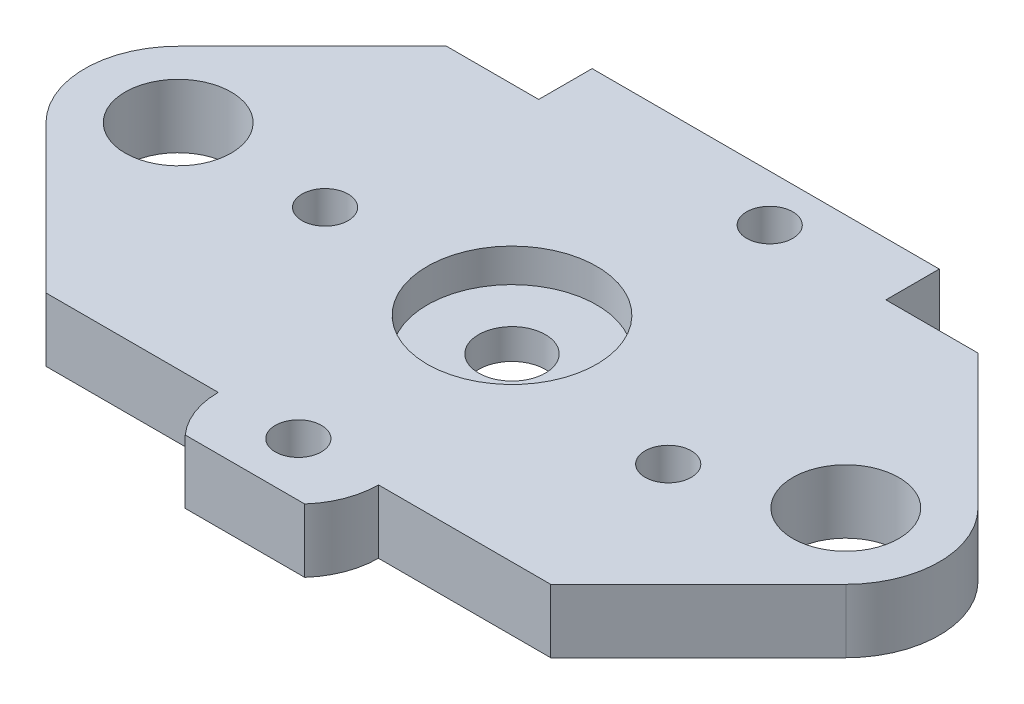
ISO-10303-21;
HEADER;
FILE_DESCRIPTION(('STEP AP214'),'2;1');
FILE_NAME('part.step','',(''),(''),'','','');
FILE_SCHEMA(('AUTOMOTIVE_DESIGN { 1 0 10303 214 1 1 1 1 }'));
ENDSEC;
DATA;
#1=APPLICATION_CONTEXT('core data for automotive mechanical design processes');
#2=APPLICATION_PROTOCOL_DEFINITION('international standard','automotive_design',2000,#1);
#3=PRODUCT_CONTEXT('',#1,'mechanical');
#4=PRODUCT('Part','Part','',(#3));
#5=PRODUCT_RELATED_PRODUCT_CATEGORY('part','',(#4));
#6=PRODUCT_DEFINITION_FORMATION('','',#4);
#7=PRODUCT_DEFINITION_CONTEXT('part definition',#1,'design');
#8=PRODUCT_DEFINITION('design','',#6,#7);
#9=PRODUCT_DEFINITION_SHAPE('','',#8);
#10=(LENGTH_UNIT() NAMED_UNIT(*) SI_UNIT(.MILLI.,.METRE.));
#11=(NAMED_UNIT(*) PLANE_ANGLE_UNIT() SI_UNIT($,.RADIAN.));
#12=(NAMED_UNIT(*) SI_UNIT($,.STERADIAN.) SOLID_ANGLE_UNIT());
#13=UNCERTAINTY_MEASURE_WITH_UNIT(LENGTH_MEASURE(1.E-05),#10,'distance_accuracy_value','');
#14=(GEOMETRIC_REPRESENTATION_CONTEXT(3) GLOBAL_UNCERTAINTY_ASSIGNED_CONTEXT((#13)) GLOBAL_UNIT_ASSIGNED_CONTEXT((#10,
#11,#12)) REPRESENTATION_CONTEXT('',''));
#15=CARTESIAN_POINT('',(0.,0.,0.));
#16=DIRECTION('',(0.,0.,1.));
#17=DIRECTION('',(1.,0.,0.));
#18=AXIS2_PLACEMENT_3D('',#15,#16,#17);
#19=CARTESIAN_POINT('',(0.,0.,0.));
#20=DIRECTION('',(0.,1.,0.));
#21=DIRECTION('',(0.,0.,1.));
#22=AXIS2_PLACEMENT_3D('',#19,#20,#21);
#23=CYLINDRICAL_SURFACE('',#22,2.5);
#24=CARTESIAN_POINT('',(0.,0.,0.));
#25=DIRECTION('',(0.,1.,0.));
#26=DIRECTION('',(0.,0.,1.));
#27=AXIS2_PLACEMENT_3D('',#24,#25,#26);
#28=CIRCLE('',#27,2.5);
#29=CARTESIAN_POINT('',(0.,0.,2.5));
#30=VERTEX_POINT('',#29);
#31=EDGE_CURVE('E11',#30,#30,#28,.T.);
#32=ORIENTED_EDGE('',*,*,#31,.F.);
#33=EDGE_LOOP('',(#32));
#34=FACE_BOUND('',#33,.T.);
#35=CARTESIAN_POINT('',(0.,2.2625,0.));
#36=DIRECTION('',(0.,1.,0.));
#37=DIRECTION('',(0.,0.,1.));
#38=AXIS2_PLACEMENT_3D('',#35,#36,#37);
#39=CIRCLE('',#38,2.5);
#40=CARTESIAN_POINT('',(0.,2.2625,2.5));
#41=VERTEX_POINT('',#40);
#42=EDGE_CURVE('E35',#41,#41,#39,.F.);
#43=ORIENTED_EDGE('',*,*,#42,.F.);
#44=EDGE_LOOP('',(#43));
#45=FACE_BOUND('',#44,.T.);
#46=ADVANCED_FACE('F31',(#34,#45),#23,.F.);
#47=CARTESIAN_POINT('',(-32.5,4.7625,22.5));
#48=DIRECTION('',(0.,1.,0.));
#49=DIRECTION('',(0.,0.,1.));
#50=AXIS2_PLACEMENT_3D('',#47,#48,#49);
#51=PLANE('',#50);
#52=CARTESIAN_POINT('',(0.,4.7625,0.));
#53=DIRECTION('',(0.,1.,0.));
#54=DIRECTION('',(0.,0.,1.));
#55=AXIS2_PLACEMENT_3D('',#52,#53,#54);
#56=CIRCLE('',#55,6.35);
#57=CARTESIAN_POINT('',(0.,4.7625,6.35));
#58=VERTEX_POINT('',#57);
#59=EDGE_CURVE('E469',#58,#58,#56,.T.);
#60=ORIENTED_EDGE('',*,*,#59,.F.);
#61=EDGE_LOOP('',(#60));
#62=FACE_BOUND('',#61,.T.);
#63=CARTESIAN_POINT('',(0.,4.7625,16.));
#64=DIRECTION('',(0.,1.,0.));
#65=DIRECTION('',(0.,0.,1.));
#66=AXIS2_PLACEMENT_3D('',#63,#64,#65);
#67=CIRCLE('',#66,1.72719999999999);
#68=CARTESIAN_POINT('',(0.,4.7625,17.7272));
#69=VERTEX_POINT('',#68);
#70=EDGE_CURVE('E197',#69,#69,#67,.T.);
#71=ORIENTED_EDGE('',*,*,#70,.F.);
#72=EDGE_LOOP('',(#71));
#73=FACE_BOUND('',#72,.T.);
#74=CARTESIAN_POINT('',(3.8,4.7625,-15.5));
#75=DIRECTION('',(0.,1.,0.));
#76=DIRECTION('',(0.,0.,1.));
#77=AXIS2_PLACEMENT_3D('',#74,#75,#76);
#78=CIRCLE('',#77,1.72719999999999);
#79=CARTESIAN_POINT('',(3.8,4.7625,-13.7728));
#80=VERTEX_POINT('',#79);
#81=EDGE_CURVE('E191',#80,#80,#78,.T.);
#82=ORIENTED_EDGE('',*,*,#81,.F.);
#83=EDGE_LOOP('',(#82));
#84=FACE_BOUND('',#83,.T.);
#85=CARTESIAN_POINT('',(-14.,4.7625,0.));
#86=DIRECTION('',(0.,1.,0.));
#87=DIRECTION('',(0.,0.,1.));
#88=AXIS2_PLACEMENT_3D('',#85,#86,#87);
#89=CIRCLE('',#88,1.72719999999999);
#90=CARTESIAN_POINT('',(-14.,4.7625,1.72719999999999));
#91=VERTEX_POINT('',#90);
#92=EDGE_CURVE('E185',#91,#91,#89,.T.);
#93=ORIENTED_EDGE('',*,*,#92,.F.);
#94=EDGE_LOOP('',(#93));
#95=FACE_BOUND('',#94,.T.);
#96=CARTESIAN_POINT('',(15.5,4.7625,3.8));
#97=DIRECTION('',(0.,1.,0.));
#98=DIRECTION('',(0.,0.,1.));
#99=AXIS2_PLACEMENT_3D('',#96,#97,#98);
#100=CIRCLE('',#99,1.72719999999999);
#101=CARTESIAN_POINT('',(15.5,4.7625,5.52719999999999));
#102=VERTEX_POINT('',#101);
#103=EDGE_CURVE('E177',#102,#102,#100,.T.);
#104=ORIENTED_EDGE('',*,*,#103,.F.);
#105=EDGE_LOOP('',(#104));
#106=FACE_BOUND('',#105,.T.);
#107=CARTESIAN_POINT('',(-25.,4.7625,0.));
#108=DIRECTION('',(0.,1.,0.));
#109=DIRECTION('',(0.,0.,1.));
#110=AXIS2_PLACEMENT_3D('',#107,#108,#109);
#111=CIRCLE('',#110,3.96875);
#112=CARTESIAN_POINT('',(-25.,4.7625,3.96875));
#113=VERTEX_POINT('',#112);
#114=EDGE_CURVE('E171',#113,#113,#111,.T.);
#115=ORIENTED_EDGE('',*,*,#114,.F.);
#116=EDGE_LOOP('',(#115));
#117=FACE_BOUND('',#116,.T.);
#118=CARTESIAN_POINT('',(25.,4.7625,0.));
#119=DIRECTION('',(0.,1.,0.));
#120=DIRECTION('',(0.,0.,1.));
#121=AXIS2_PLACEMENT_3D('',#118,#119,#120);
#122=CIRCLE('',#121,3.96875);
#123=CARTESIAN_POINT('',(25.,4.7625,3.96875));
#124=VERTEX_POINT('',#123);
#125=EDGE_CURVE('E158',#124,#124,#122,.T.);
#126=ORIENTED_EDGE('',*,*,#125,.F.);
#127=EDGE_LOOP('',(#126));
#128=FACE_BOUND('',#127,.T.);
#129=CARTESIAN_POINT('',(0.,4.7625,16.));
#130=DIRECTION('',(0.,1.,0.));
#131=DIRECTION('',(0.,0.,1.));
#132=AXIS2_PLACEMENT_3D('',#129,#130,#131);
#133=CIRCLE('',#132,6.);
#134=CARTESIAN_POINT('',(-6.,4.7625,16.));
#135=VERTEX_POINT('',#134);
#136=CARTESIAN_POINT('',(-4.47213595499959,4.7625,20.));
#137=VERTEX_POINT('',#136);
#138=EDGE_CURVE('E230',#135,#137,#133,.T.);
#139=ORIENTED_EDGE('',*,*,#138,.T.);
#140=DIRECTION('',(-1.,0.,0.));
#141=VECTOR('',#140,1.);
#142=CARTESIAN_POINT('',(4.47213595499959,4.7625,20.));
#143=LINE('',#142,#141);
#144=CARTESIAN_POINT('',(4.47213595499959,4.7625,20.));
#145=VERTEX_POINT('',#144);
#146=EDGE_CURVE('E135',#145,#137,#143,.T.);
#147=ORIENTED_EDGE('',*,*,#146,.F.);
#148=CARTESIAN_POINT('',(0.,4.7625,16.));
#149=DIRECTION('',(0.,-1.,0.));
#150=DIRECTION('',(0.,0.,1.));
#151=AXIS2_PLACEMENT_3D('',#148,#149,#150);
#152=CIRCLE('',#151,6.);
#153=CARTESIAN_POINT('',(6.,4.7625,16.));
#154=VERTEX_POINT('',#153);
#155=EDGE_CURVE('E133',#154,#145,#152,.T.);
#156=ORIENTED_EDGE('',*,*,#155,.F.);
#157=DIRECTION('',(-1.,0.,0.));
#158=VECTOR('',#157,1.);
#159=CARTESIAN_POINT('',(6.,4.7625,16.));
#160=LINE('',#159,#158);
#161=CARTESIAN_POINT('',(18.8994949366118,4.7625,16.));
#162=VERTEX_POINT('',#161);
#163=EDGE_CURVE('E154',#162,#154,#160,.T.);
#164=ORIENTED_EDGE('',*,*,#163,.F.);
#165=DIRECTION('',(-0.707106781186543,0.,0.707106781186552));
#166=VECTOR('',#165,1.);
#167=CARTESIAN_POINT('',(18.8994949366118,4.7625,16.));
#168=LINE('',#167,#166);
#169=CARTESIAN_POINT('',(29.9497474683059,4.7625,4.9497474683058));
#170=VERTEX_POINT('',#169);
#171=EDGE_CURVE('E152',#170,#162,#168,.T.);
#172=ORIENTED_EDGE('',*,*,#171,.F.);
#173=CARTESIAN_POINT('',(25.,4.7625,0.));
#174=DIRECTION('',(0.,-1.,0.));
#175=DIRECTION('',(0.,0.,1.));
#176=AXIS2_PLACEMENT_3D('',#173,#174,#175);
#177=CIRCLE('',#176,7.);
#178=CARTESIAN_POINT('',(29.9497474683058,4.7625,-4.94974746830586));
#179=VERTEX_POINT('',#178);
#180=EDGE_CURVE('E111',#179,#170,#177,.T.);
#181=ORIENTED_EDGE('',*,*,#180,.F.);
#182=DIRECTION('',(0.707106781186552,0.,0.707106781186543));
#183=VECTOR('',#182,1.);
#184=CARTESIAN_POINT('',(29.9497474683058,4.7625,-4.94974746830586));
#185=LINE('',#184,#183);
#186=CARTESIAN_POINT('',(19.8994949366115,4.7625,-15.));
#187=VERTEX_POINT('',#186);
#188=EDGE_CURVE('E148',#187,#179,#185,.T.);
#189=ORIENTED_EDGE('',*,*,#188,.F.);
#190=DIRECTION('',(1.,0.,0.));
#191=VECTOR('',#190,1.);
#192=CARTESIAN_POINT('',(13.,4.7625,-15.));
#193=LINE('',#192,#191);
#194=CARTESIAN_POINT('',(13.,4.7625,-15.));
#195=VERTEX_POINT('',#194);
#196=EDGE_CURVE('E145',#195,#187,#193,.T.);
#197=ORIENTED_EDGE('',*,*,#196,.F.);
#198=DIRECTION('',(0.,0.,1.));
#199=VECTOR('',#198,1.);
#200=CARTESIAN_POINT('',(13.,4.7625,-19.));
#201=LINE('',#200,#199);
#202=CARTESIAN_POINT('',(13.,4.7625,-19.));
#203=VERTEX_POINT('',#202);
#204=EDGE_CURVE('E142',#203,#195,#201,.T.);
#205=ORIENTED_EDGE('',*,*,#204,.F.);
#206=DIRECTION('',(1.,0.,0.));
#207=VECTOR('',#206,1.);
#208=CARTESIAN_POINT('',(13.,4.7625,-19.));
#209=LINE('',#208,#207);
#210=CARTESIAN_POINT('',(-13.,4.7625,-19.));
#211=VERTEX_POINT('',#210);
#212=EDGE_CURVE('E139',#211,#203,#209,.T.);
#213=ORIENTED_EDGE('',*,*,#212,.F.);
#214=DIRECTION('',(0.,0.,1.));
#215=VECTOR('',#214,1.);
#216=CARTESIAN_POINT('',(-13.,4.7625,-19.));
#217=LINE('',#216,#215);
#218=CARTESIAN_POINT('',(-13.,4.7625,-15.));
#219=VERTEX_POINT('',#218);
#220=EDGE_CURVE('E260',#211,#219,#217,.T.);
#221=ORIENTED_EDGE('',*,*,#220,.T.);
#222=DIRECTION('',(-1.,0.,0.));
#223=VECTOR('',#222,1.);
#224=CARTESIAN_POINT('',(-13.,4.7625,-15.));
#225=LINE('',#224,#223);
#226=CARTESIAN_POINT('',(-19.8994949366115,4.7625,-15.));
#227=VERTEX_POINT('',#226);
#228=EDGE_CURVE('E257',#219,#227,#225,.T.);
#229=ORIENTED_EDGE('',*,*,#228,.T.);
#230=DIRECTION('',(-0.707106781186552,0.,0.707106781186543));
#231=VECTOR('',#230,1.);
#232=CARTESIAN_POINT('',(-29.9497474683058,4.7625,-4.94974746830586));
#233=LINE('',#232,#231);
#234=CARTESIAN_POINT('',(-29.9497474683058,4.7625,-4.94974746830586));
#235=VERTEX_POINT('',#234);
#236=EDGE_CURVE('E254',#227,#235,#233,.T.);
#237=ORIENTED_EDGE('',*,*,#236,.T.);
#238=CARTESIAN_POINT('',(-25.,4.7625,0.));
#239=DIRECTION('',(0.,1.,0.));
#240=DIRECTION('',(0.,0.,1.));
#241=AXIS2_PLACEMENT_3D('',#238,#239,#240);
#242=CIRCLE('',#241,7.);
#243=CARTESIAN_POINT('',(-29.9497474683059,4.7625,4.9497474683058));
#244=VERTEX_POINT('',#243);
#245=EDGE_CURVE('E251',#235,#244,#242,.T.);
#246=ORIENTED_EDGE('',*,*,#245,.T.);
#247=DIRECTION('',(0.707106781186543,0.,0.707106781186552));
#248=VECTOR('',#247,1.);
#249=CARTESIAN_POINT('',(-18.8994949366118,4.7625,16.));
#250=LINE('',#249,#248);
#251=CARTESIAN_POINT('',(-18.8994949366118,4.7625,16.));
#252=VERTEX_POINT('',#251);
#253=EDGE_CURVE('E242',#244,#252,#250,.T.);
#254=ORIENTED_EDGE('',*,*,#253,.T.);
#255=DIRECTION('',(1.,0.,0.));
#256=VECTOR('',#255,1.);
#257=CARTESIAN_POINT('',(-6.,4.7625,16.));
#258=LINE('',#257,#256);
#259=EDGE_CURVE('E235',#252,#135,#258,.T.);
#260=ORIENTED_EDGE('',*,*,#259,.T.);
#261=EDGE_LOOP('',(#139,#147,#156,#164,#172,#181,#189,#197,#205,#213,#221,#229,#237,#246,#254,#260));
#262=FACE_BOUND('',#261,.T.);
#263=ADVANCED_FACE('F212',(#62,#73,#84,#95,#106,#117,#128,#262),#51,.T.);
#264=CARTESIAN_POINT('',(-32.5,0.,22.5));
#265=DIRECTION('',(0.,1.,0.));
#266=DIRECTION('',(0.,0.,1.));
#267=AXIS2_PLACEMENT_3D('',#264,#265,#266);
#268=PLANE('',#267);
#269=ORIENTED_EDGE('',*,*,#31,.T.);
#270=EDGE_LOOP('',(#269));
#271=FACE_BOUND('',#270,.T.);
#272=CARTESIAN_POINT('',(0.,0.,16.));
#273=DIRECTION('',(0.,1.,0.));
#274=DIRECTION('',(0.,0.,1.));
#275=AXIS2_PLACEMENT_3D('',#272,#273,#274);
#276=CIRCLE('',#275,1.7272);
#277=CARTESIAN_POINT('',(0.,0.,17.7272));
#278=VERTEX_POINT('',#277);
#279=EDGE_CURVE('E41',#278,#278,#276,.T.);
#280=ORIENTED_EDGE('',*,*,#279,.T.);
#281=EDGE_LOOP('',(#280));
#282=FACE_BOUND('',#281,.T.);
#283=CARTESIAN_POINT('',(3.8,0.,-15.5));
#284=DIRECTION('',(0.,1.,0.));
#285=DIRECTION('',(0.,0.,1.));
#286=AXIS2_PLACEMENT_3D('',#283,#284,#285);
#287=CIRCLE('',#286,1.7272);
#288=CARTESIAN_POINT('',(3.8,0.,-13.7728));
#289=VERTEX_POINT('',#288);
#290=EDGE_CURVE('E194',#289,#289,#287,.T.);
#291=ORIENTED_EDGE('',*,*,#290,.T.);
#292=EDGE_LOOP('',(#291));
#293=FACE_BOUND('',#292,.T.);
#294=CARTESIAN_POINT('',(-14.,0.,0.));
#295=DIRECTION('',(0.,1.,0.));
#296=DIRECTION('',(0.,0.,1.));
#297=AXIS2_PLACEMENT_3D('',#294,#295,#296);
#298=CIRCLE('',#297,1.7272);
#299=CARTESIAN_POINT('',(-14.,0.,1.7272));
#300=VERTEX_POINT('',#299);
#301=EDGE_CURVE('E188',#300,#300,#298,.T.);
#302=ORIENTED_EDGE('',*,*,#301,.T.);
#303=EDGE_LOOP('',(#302));
#304=FACE_BOUND('',#303,.T.);
#305=CARTESIAN_POINT('',(15.5,0.,3.8));
#306=DIRECTION('',(0.,1.,0.));
#307=DIRECTION('',(0.,0.,1.));
#308=AXIS2_PLACEMENT_3D('',#305,#306,#307);
#309=CIRCLE('',#308,1.7272);
#310=CARTESIAN_POINT('',(15.5,0.,5.5272));
#311=VERTEX_POINT('',#310);
#312=EDGE_CURVE('E182',#311,#311,#309,.T.);
#313=ORIENTED_EDGE('',*,*,#312,.T.);
#314=EDGE_LOOP('',(#313));
#315=FACE_BOUND('',#314,.T.);
#316=CARTESIAN_POINT('',(-25.,0.,0.));
#317=DIRECTION('',(0.,1.,0.));
#318=DIRECTION('',(0.,0.,1.));
#319=AXIS2_PLACEMENT_3D('',#316,#317,#318);
#320=CIRCLE('',#319,3.96875);
#321=CARTESIAN_POINT('',(-25.,0.,3.96875));
#322=VERTEX_POINT('',#321);
#323=EDGE_CURVE('E174',#322,#322,#320,.T.);
#324=ORIENTED_EDGE('',*,*,#323,.T.);
#325=EDGE_LOOP('',(#324));
#326=FACE_BOUND('',#325,.T.);
#327=CARTESIAN_POINT('',(25.,0.,0.));
#328=DIRECTION('',(0.,1.,0.));
#329=DIRECTION('',(0.,0.,1.));
#330=AXIS2_PLACEMENT_3D('',#327,#328,#329);
#331=CIRCLE('',#330,3.96875);
#332=CARTESIAN_POINT('',(25.,0.,3.96875));
#333=VERTEX_POINT('',#332);
#334=EDGE_CURVE('E168',#333,#333,#331,.T.);
#335=ORIENTED_EDGE('',*,*,#334,.T.);
#336=EDGE_LOOP('',(#335));
#337=FACE_BOUND('',#336,.T.);
#338=DIRECTION('',(-1.,0.,0.));
#339=VECTOR('',#338,1.);
#340=CARTESIAN_POINT('',(4.47213595499959,0.,20.));
#341=LINE('',#340,#339);
#342=CARTESIAN_POINT('',(4.47213595499959,0.,20.));
#343=VERTEX_POINT('',#342);
#344=CARTESIAN_POINT('',(-4.47213595499959,0.,20.));
#345=VERTEX_POINT('',#344);
#346=EDGE_CURVE('E288',#343,#345,#341,.T.);
#347=ORIENTED_EDGE('',*,*,#346,.T.);
#348=CARTESIAN_POINT('',(0.,0.,16.));
#349=DIRECTION('',(0.,1.,0.));
#350=DIRECTION('',(0.,0.,1.));
#351=AXIS2_PLACEMENT_3D('',#348,#349,#350);
#352=CIRCLE('',#351,6.);
#353=CARTESIAN_POINT('',(-6.,0.,16.));
#354=VERTEX_POINT('',#353);
#355=EDGE_CURVE('E263',#354,#345,#352,.T.);
#356=ORIENTED_EDGE('',*,*,#355,.F.);
#357=DIRECTION('',(1.,0.,0.));
#358=VECTOR('',#357,1.);
#359=CARTESIAN_POINT('',(-6.,0.,16.));
#360=LINE('',#359,#358);
#361=CARTESIAN_POINT('',(-18.8994949366118,0.,16.));
#362=VERTEX_POINT('',#361);
#363=EDGE_CURVE('E475',#362,#354,#360,.T.);
#364=ORIENTED_EDGE('',*,*,#363,.F.);
#365=DIRECTION('',(0.707106781186543,0.,0.707106781186552));
#366=VECTOR('',#365,1.);
#367=CARTESIAN_POINT('',(-18.8994949366118,0.,16.));
#368=LINE('',#367,#366);
#369=CARTESIAN_POINT('',(-29.9497474683059,0.,4.9497474683058));
#370=VERTEX_POINT('',#369);
#371=EDGE_CURVE('E478',#370,#362,#368,.T.);
#372=ORIENTED_EDGE('',*,*,#371,.F.);
#373=CARTESIAN_POINT('',(-25.,0.,0.));
#374=DIRECTION('',(0.,1.,0.));
#375=DIRECTION('',(0.,0.,1.));
#376=AXIS2_PLACEMENT_3D('',#373,#374,#375);
#377=CIRCLE('',#376,7.);
#378=CARTESIAN_POINT('',(-29.9497474683058,0.,-4.94974746830586));
#379=VERTEX_POINT('',#378);
#380=EDGE_CURVE('E481',#379,#370,#377,.T.);
#381=ORIENTED_EDGE('',*,*,#380,.F.);
#382=DIRECTION('',(-0.707106781186552,0.,0.707106781186543));
#383=VECTOR('',#382,1.);
#384=CARTESIAN_POINT('',(-29.9497474683058,0.,-4.94974746830586));
#385=LINE('',#384,#383);
#386=CARTESIAN_POINT('',(-19.8994949366115,0.,-15.));
#387=VERTEX_POINT('',#386);
#388=EDGE_CURVE('E484',#387,#379,#385,.T.);
#389=ORIENTED_EDGE('',*,*,#388,.F.);
#390=DIRECTION('',(-1.,0.,0.));
#391=VECTOR('',#390,1.);
#392=CARTESIAN_POINT('',(-13.,0.,-15.));
#393=LINE('',#392,#391);
#394=CARTESIAN_POINT('',(-13.,0.,-15.));
#395=VERTEX_POINT('',#394);
#396=EDGE_CURVE('E486',#395,#387,#393,.T.);
#397=ORIENTED_EDGE('',*,*,#396,.F.);
#398=DIRECTION('',(0.,0.,1.));
#399=VECTOR('',#398,1.);
#400=CARTESIAN_POINT('',(-13.,0.,-19.));
#401=LINE('',#400,#399);
#402=CARTESIAN_POINT('',(-13.,0.,-19.));
#403=VERTEX_POINT('',#402);
#404=EDGE_CURVE('E247',#403,#395,#401,.T.);
#405=ORIENTED_EDGE('',*,*,#404,.F.);
#406=DIRECTION('',(1.,0.,0.));
#407=VECTOR('',#406,1.);
#408=CARTESIAN_POINT('',(13.,0.,-19.));
#409=LINE('',#408,#407);
#410=CARTESIAN_POINT('',(13.,0.,-19.));
#411=VERTEX_POINT('',#410);
#412=EDGE_CURVE('E290',#403,#411,#409,.T.);
#413=ORIENTED_EDGE('',*,*,#412,.T.);
#414=DIRECTION('',(0.,0.,1.));
#415=VECTOR('',#414,1.);
#416=CARTESIAN_POINT('',(13.,0.,-19.));
#417=LINE('',#416,#415);
#418=CARTESIAN_POINT('',(13.,0.,-15.));
#419=VERTEX_POINT('',#418);
#420=EDGE_CURVE('E293',#411,#419,#417,.T.);
#421=ORIENTED_EDGE('',*,*,#420,.T.);
#422=DIRECTION('',(1.,0.,0.));
#423=VECTOR('',#422,1.);
#424=CARTESIAN_POINT('',(13.,0.,-15.));
#425=LINE('',#424,#423);
#426=CARTESIAN_POINT('',(19.8994949366115,0.,-15.));
#427=VERTEX_POINT('',#426);
#428=EDGE_CURVE('E128',#419,#427,#425,.T.);
#429=ORIENTED_EDGE('',*,*,#428,.T.);
#430=DIRECTION('',(0.707106781186552,0.,0.707106781186543));
#431=VECTOR('',#430,1.);
#432=CARTESIAN_POINT('',(29.9497474683058,0.,-4.94974746830586));
#433=LINE('',#432,#431);
#434=CARTESIAN_POINT('',(29.9497474683058,0.,-4.94974746830586));
#435=VERTEX_POINT('',#434);
#436=EDGE_CURVE('E126',#427,#435,#433,.T.);
#437=ORIENTED_EDGE('',*,*,#436,.T.);
#438=CARTESIAN_POINT('',(25.,0.,0.));
#439=DIRECTION('',(0.,-1.,0.));
#440=DIRECTION('',(0.,0.,1.));
#441=AXIS2_PLACEMENT_3D('',#438,#439,#440);
#442=CIRCLE('',#441,7.);
#443=CARTESIAN_POINT('',(29.9497474683059,0.,4.9497474683058));
#444=VERTEX_POINT('',#443);
#445=EDGE_CURVE('E108',#435,#444,#442,.T.);
#446=ORIENTED_EDGE('',*,*,#445,.T.);
#447=DIRECTION('',(-0.707106781186543,0.,0.707106781186552));
#448=VECTOR('',#447,1.);
#449=CARTESIAN_POINT('',(18.8994949366118,0.,16.));
#450=LINE('',#449,#448);
#451=CARTESIAN_POINT('',(18.8994949366118,0.,16.));
#452=VERTEX_POINT('',#451);
#453=EDGE_CURVE('E117',#444,#452,#450,.T.);
#454=ORIENTED_EDGE('',*,*,#453,.T.);
#455=DIRECTION('',(-1.,0.,0.));
#456=VECTOR('',#455,1.);
#457=CARTESIAN_POINT('',(6.,0.,16.));
#458=LINE('',#457,#456);
#459=CARTESIAN_POINT('',(6.,0.,16.));
#460=VERTEX_POINT('',#459);
#461=EDGE_CURVE('E121',#452,#460,#458,.T.);
#462=ORIENTED_EDGE('',*,*,#461,.T.);
#463=CARTESIAN_POINT('',(0.,0.,16.));
#464=DIRECTION('',(0.,-1.,0.));
#465=DIRECTION('',(0.,0.,1.));
#466=AXIS2_PLACEMENT_3D('',#463,#464,#465);
#467=CIRCLE('',#466,6.);
#468=EDGE_CURVE('E156',#460,#343,#467,.T.);
#469=ORIENTED_EDGE('',*,*,#468,.T.);
#470=EDGE_LOOP('',(#347,#356,#364,#372,#381,#389,#397,#405,#413,#421,#429,#437,#446,#454,#462,#469));
#471=FACE_BOUND('',#470,.T.);
#472=ADVANCED_FACE('F33',(#271,#282,#293,#304,#315,#326,#337,#471),#268,.F.);
#473=CARTESIAN_POINT('',(0.,4.7625,16.));
#474=DIRECTION('',(0.,1.,0.));
#475=DIRECTION('',(0.,0.,1.));
#476=AXIS2_PLACEMENT_3D('',#473,#474,#475);
#477=CYLINDRICAL_SURFACE('',#476,1.72719999999999);
#478=ORIENTED_EDGE('',*,*,#279,.F.);
#479=EDGE_LOOP('',(#478));
#480=FACE_BOUND('',#479,.T.);
#481=ORIENTED_EDGE('',*,*,#70,.T.);
#482=EDGE_LOOP('',(#481));
#483=FACE_BOUND('',#482,.T.);
#484=ADVANCED_FACE('F205',(#480,#483),#477,.F.);
#485=CARTESIAN_POINT('',(3.8,4.7625,-15.5));
#486=DIRECTION('',(0.,1.,0.));
#487=DIRECTION('',(0.,0.,1.));
#488=AXIS2_PLACEMENT_3D('',#485,#486,#487);
#489=CYLINDRICAL_SURFACE('',#488,1.72719999999999);
#490=ORIENTED_EDGE('',*,*,#290,.F.);
#491=EDGE_LOOP('',(#490));
#492=FACE_BOUND('',#491,.T.);
#493=ORIENTED_EDGE('',*,*,#81,.T.);
#494=EDGE_LOOP('',(#493));
#495=FACE_BOUND('',#494,.T.);
#496=ADVANCED_FACE('F208',(#492,#495),#489,.F.);
#497=CARTESIAN_POINT('',(-14.,4.7625,0.));
#498=DIRECTION('',(0.,1.,0.));
#499=DIRECTION('',(0.,0.,1.));
#500=AXIS2_PLACEMENT_3D('',#497,#498,#499);
#501=CYLINDRICAL_SURFACE('',#500,1.72719999999999);
#502=ORIENTED_EDGE('',*,*,#301,.F.);
#503=EDGE_LOOP('',(#502));
#504=FACE_BOUND('',#503,.T.);
#505=ORIENTED_EDGE('',*,*,#92,.T.);
#506=EDGE_LOOP('',(#505));
#507=FACE_BOUND('',#506,.T.);
#508=ADVANCED_FACE('F327',(#504,#507),#501,.F.);
#509=CARTESIAN_POINT('',(15.5,4.7625,3.8));
#510=DIRECTION('',(0.,1.,0.));
#511=DIRECTION('',(0.,0.,1.));
#512=AXIS2_PLACEMENT_3D('',#509,#510,#511);
#513=CYLINDRICAL_SURFACE('',#512,1.72719999999999);
#514=ORIENTED_EDGE('',*,*,#312,.F.);
#515=EDGE_LOOP('',(#514));
#516=FACE_BOUND('',#515,.T.);
#517=ORIENTED_EDGE('',*,*,#103,.T.);
#518=EDGE_LOOP('',(#517));
#519=FACE_BOUND('',#518,.T.);
#520=ADVANCED_FACE('F331',(#516,#519),#513,.F.);
#521=CARTESIAN_POINT('',(-25.,0.,0.));
#522=DIRECTION('',(0.,1.,0.));
#523=DIRECTION('',(0.,0.,1.));
#524=AXIS2_PLACEMENT_3D('',#521,#522,#523);
#525=CYLINDRICAL_SURFACE('',#524,3.96875);
#526=ORIENTED_EDGE('',*,*,#323,.F.);
#527=EDGE_LOOP('',(#526));
#528=FACE_BOUND('',#527,.T.);
#529=ORIENTED_EDGE('',*,*,#114,.T.);
#530=EDGE_LOOP('',(#529));
#531=FACE_BOUND('',#530,.T.);
#532=ADVANCED_FACE('F335',(#528,#531),#525,.F.);
#533=CARTESIAN_POINT('',(25.,0.,0.));
#534=DIRECTION('',(0.,1.,0.));
#535=DIRECTION('',(0.,0.,1.));
#536=AXIS2_PLACEMENT_3D('',#533,#534,#535);
#537=CYLINDRICAL_SURFACE('',#536,3.96875);
#538=ORIENTED_EDGE('',*,*,#334,.F.);
#539=EDGE_LOOP('',(#538));
#540=FACE_BOUND('',#539,.T.);
#541=ORIENTED_EDGE('',*,*,#125,.T.);
#542=EDGE_LOOP('',(#541));
#543=FACE_BOUND('',#542,.T.);
#544=ADVANCED_FACE('F313',(#540,#543),#537,.F.);
#545=CARTESIAN_POINT('',(0.,0.,16.));
#546=DIRECTION('',(0.,1.,0.));
#547=DIRECTION('',(0.,0.,1.));
#548=AXIS2_PLACEMENT_3D('',#545,#546,#547);
#549=CYLINDRICAL_SURFACE('',#548,6.);
#550=ORIENTED_EDGE('',*,*,#155,.T.);
#551=DIRECTION('',(0.,1.,0.));
#552=VECTOR('',#551,1.);
#553=CARTESIAN_POINT('',(4.47213595499959,0.,20.));
#554=LINE('',#553,#552);
#555=EDGE_CURVE('E84',#343,#145,#554,.T.);
#556=ORIENTED_EDGE('',*,*,#555,.F.);
#557=ORIENTED_EDGE('',*,*,#468,.F.);
#558=DIRECTION('',(0.,1.,0.));
#559=VECTOR('',#558,1.);
#560=CARTESIAN_POINT('',(6.,0.,16.));
#561=LINE('',#560,#559);
#562=EDGE_CURVE('E49',#460,#154,#561,.T.);
#563=ORIENTED_EDGE('',*,*,#562,.T.);
#564=EDGE_LOOP('',(#550,#556,#557,#563));
#565=FACE_BOUND('',#564,.T.);
#566=ADVANCED_FACE('F306',(#565),#549,.T.);
#567=CARTESIAN_POINT('',(6.,0.,16.));
#568=DIRECTION('',(0.,0.,-1.));
#569=DIRECTION('',(-1.,0.,0.));
#570=AXIS2_PLACEMENT_3D('',#567,#568,#569);
#571=PLANE('',#570);
#572=ORIENTED_EDGE('',*,*,#163,.T.);
#573=ORIENTED_EDGE('',*,*,#562,.F.);
#574=ORIENTED_EDGE('',*,*,#461,.F.);
#575=DIRECTION('',(0.,1.,0.));
#576=VECTOR('',#575,1.);
#577=CARTESIAN_POINT('',(18.8994949366118,0.,16.));
#578=LINE('',#577,#576);
#579=EDGE_CURVE('E76',#452,#162,#578,.T.);
#580=ORIENTED_EDGE('',*,*,#579,.T.);
#581=EDGE_LOOP('',(#572,#573,#574,#580));
#582=FACE_BOUND('',#581,.T.);
#583=ADVANCED_FACE('F304',(#582),#571,.F.);
#584=CARTESIAN_POINT('',(18.8994949366118,0.,16.));
#585=DIRECTION('',(-0.707106781186552,0.,-0.707106781186543));
#586=DIRECTION('',(-0.707106781186543,0.,0.707106781186552));
#587=AXIS2_PLACEMENT_3D('',#584,#585,#586);
#588=PLANE('',#587);
#589=ORIENTED_EDGE('',*,*,#171,.T.);
#590=ORIENTED_EDGE('',*,*,#579,.F.);
#591=ORIENTED_EDGE('',*,*,#453,.F.);
#592=DIRECTION('',(0.,1.,0.));
#593=VECTOR('',#592,1.);
#594=CARTESIAN_POINT('',(29.9497474683059,0.,4.9497474683058));
#595=LINE('',#594,#593);
#596=EDGE_CURVE('E104',#444,#170,#595,.T.);
#597=ORIENTED_EDGE('',*,*,#596,.T.);
#598=EDGE_LOOP('',(#589,#590,#591,#597));
#599=FACE_BOUND('',#598,.T.);
#600=ADVANCED_FACE('F118',(#599),#588,.F.);
#601=CARTESIAN_POINT('',(25.,0.,0.));
#602=DIRECTION('',(0.,1.,0.));
#603=DIRECTION('',(0.,0.,1.));
#604=AXIS2_PLACEMENT_3D('',#601,#602,#603);
#605=CYLINDRICAL_SURFACE('',#604,7.);
#606=ORIENTED_EDGE('',*,*,#180,.T.);
#607=ORIENTED_EDGE('',*,*,#596,.F.);
#608=ORIENTED_EDGE('',*,*,#445,.F.);
#609=DIRECTION('',(0.,1.,0.));
#610=VECTOR('',#609,1.);
#611=CARTESIAN_POINT('',(29.9497474683058,0.,-4.94974746830586));
#612=LINE('',#611,#610);
#613=EDGE_CURVE('E114',#435,#179,#612,.T.);
#614=ORIENTED_EDGE('',*,*,#613,.T.);
#615=EDGE_LOOP('',(#606,#607,#608,#614));
#616=FACE_BOUND('',#615,.T.);
#617=ADVANCED_FACE('F106',(#616),#605,.T.);
#618=CARTESIAN_POINT('',(29.9497474683058,0.,-4.94974746830586));
#619=DIRECTION('',(-0.707106781186543,0.,0.707106781186552));
#620=DIRECTION('',(0.707106781186552,0.,0.707106781186543));
#621=AXIS2_PLACEMENT_3D('',#618,#619,#620);
#622=PLANE('',#621);
#623=ORIENTED_EDGE('',*,*,#188,.T.);
#624=ORIENTED_EDGE('',*,*,#613,.F.);
#625=ORIENTED_EDGE('',*,*,#436,.F.);
#626=DIRECTION('',(0.,1.,0.));
#627=VECTOR('',#626,1.);
#628=CARTESIAN_POINT('',(19.8994949366115,0.,-15.));
#629=LINE('',#628,#627);
#630=EDGE_CURVE('E161',#427,#187,#629,.T.);
#631=ORIENTED_EDGE('',*,*,#630,.T.);
#632=EDGE_LOOP('',(#623,#624,#625,#631));
#633=FACE_BOUND('',#632,.T.);
#634=ADVANCED_FACE('F302',(#633),#622,.F.);
#635=CARTESIAN_POINT('',(13.,0.,-15.));
#636=DIRECTION('',(0.,0.,1.));
#637=DIRECTION('',(1.,0.,0.));
#638=AXIS2_PLACEMENT_3D('',#635,#636,#637);
#639=PLANE('',#638);
#640=ORIENTED_EDGE('',*,*,#196,.T.);
#641=ORIENTED_EDGE('',*,*,#630,.F.);
#642=ORIENTED_EDGE('',*,*,#428,.F.);
#643=DIRECTION('',(0.,1.,0.));
#644=VECTOR('',#643,1.);
#645=CARTESIAN_POINT('',(13.,0.,-15.));
#646=LINE('',#645,#644);
#647=EDGE_CURVE('E163',#419,#195,#646,.T.);
#648=ORIENTED_EDGE('',*,*,#647,.T.);
#649=EDGE_LOOP('',(#640,#641,#642,#648));
#650=FACE_BOUND('',#649,.T.);
#651=ADVANCED_FACE('F298',(#650),#639,.F.);
#652=CARTESIAN_POINT('',(13.,0.,-19.));
#653=DIRECTION('',(-1.,0.,0.));
#654=DIRECTION('',(0.,0.,1.));
#655=AXIS2_PLACEMENT_3D('',#652,#653,#654);
#656=PLANE('',#655);
#657=ORIENTED_EDGE('',*,*,#204,.T.);
#658=ORIENTED_EDGE('',*,*,#647,.F.);
#659=ORIENTED_EDGE('',*,*,#420,.F.);
#660=DIRECTION('',(0.,1.,0.));
#661=VECTOR('',#660,1.);
#662=CARTESIAN_POINT('',(13.,0.,-19.));
#663=LINE('',#662,#661);
#664=EDGE_CURVE('E165',#411,#203,#663,.T.);
#665=ORIENTED_EDGE('',*,*,#664,.T.);
#666=EDGE_LOOP('',(#657,#658,#659,#665));
#667=FACE_BOUND('',#666,.T.);
#668=ADVANCED_FACE('F351',(#667),#656,.F.);
#669=CARTESIAN_POINT('',(13.,0.,-19.));
#670=DIRECTION('',(0.,0.,1.));
#671=DIRECTION('',(1.,0.,0.));
#672=AXIS2_PLACEMENT_3D('',#669,#670,#671);
#673=PLANE('',#672);
#674=ORIENTED_EDGE('',*,*,#212,.T.);
#675=ORIENTED_EDGE('',*,*,#664,.F.);
#676=ORIENTED_EDGE('',*,*,#412,.F.);
#677=DIRECTION('',(0.,1.,0.));
#678=VECTOR('',#677,1.);
#679=CARTESIAN_POINT('',(-13.,0.,-19.));
#680=LINE('',#679,#678);
#681=EDGE_CURVE('E265',#403,#211,#680,.T.);
#682=ORIENTED_EDGE('',*,*,#681,.T.);
#683=EDGE_LOOP('',(#674,#675,#676,#682));
#684=FACE_BOUND('',#683,.T.);
#685=ADVANCED_FACE('F347',(#684),#673,.F.);
#686=CARTESIAN_POINT('',(4.47213595499959,0.,20.));
#687=DIRECTION('',(0.,0.,-1.));
#688=DIRECTION('',(-1.,0.,0.));
#689=AXIS2_PLACEMENT_3D('',#686,#687,#688);
#690=PLANE('',#689);
#691=ORIENTED_EDGE('',*,*,#146,.T.);
#692=DIRECTION('',(0.,1.,0.));
#693=VECTOR('',#692,1.);
#694=CARTESIAN_POINT('',(-4.47213595499959,0.,20.));
#695=LINE('',#694,#693);
#696=EDGE_CURVE('E136',#345,#137,#695,.T.);
#697=ORIENTED_EDGE('',*,*,#696,.F.);
#698=ORIENTED_EDGE('',*,*,#346,.F.);
#699=ORIENTED_EDGE('',*,*,#555,.T.);
#700=EDGE_LOOP('',(#691,#697,#698,#699));
#701=FACE_BOUND('',#700,.T.);
#702=ADVANCED_FACE('F343',(#701),#690,.F.);
#703=CARTESIAN_POINT('',(0.,0.,16.));
#704=DIRECTION('',(0.,1.,0.));
#705=DIRECTION('',(0.,0.,1.));
#706=AXIS2_PLACEMENT_3D('',#703,#704,#705);
#707=CYLINDRICAL_SURFACE('',#706,6.);
#708=ORIENTED_EDGE('',*,*,#138,.F.);
#709=DIRECTION('',(0.,1.,0.));
#710=VECTOR('',#709,1.);
#711=CARTESIAN_POINT('',(-6.,0.,16.));
#712=LINE('',#711,#710);
#713=EDGE_CURVE('E283',#354,#135,#712,.T.);
#714=ORIENTED_EDGE('',*,*,#713,.F.);
#715=ORIENTED_EDGE('',*,*,#355,.T.);
#716=ORIENTED_EDGE('',*,*,#696,.T.);
#717=EDGE_LOOP('',(#708,#714,#715,#716));
#718=FACE_BOUND('',#717,.T.);
#719=ADVANCED_FACE('F346',(#718),#707,.T.);
#720=CARTESIAN_POINT('',(-13.,0.,-19.));
#721=DIRECTION('',(-1.,0.,0.));
#722=DIRECTION('',(0.,0.,1.));
#723=AXIS2_PLACEMENT_3D('',#720,#721,#722);
#724=PLANE('',#723);
#725=ORIENTED_EDGE('',*,*,#220,.F.);
#726=ORIENTED_EDGE('',*,*,#681,.F.);
#727=ORIENTED_EDGE('',*,*,#404,.T.);
#728=DIRECTION('',(0.,1.,0.));
#729=VECTOR('',#728,1.);
#730=CARTESIAN_POINT('',(-13.,0.,-15.));
#731=LINE('',#730,#729);
#732=EDGE_CURVE('E268',#395,#219,#731,.T.);
#733=ORIENTED_EDGE('',*,*,#732,.T.);
#734=EDGE_LOOP('',(#725,#726,#727,#733));
#735=FACE_BOUND('',#734,.T.);
#736=ADVANCED_FACE('F392',(#735),#724,.T.);
#737=CARTESIAN_POINT('',(-13.,0.,-15.));
#738=DIRECTION('',(0.,0.,-1.));
#739=DIRECTION('',(-1.,0.,0.));
#740=AXIS2_PLACEMENT_3D('',#737,#738,#739);
#741=PLANE('',#740);
#742=ORIENTED_EDGE('',*,*,#228,.F.);
#743=ORIENTED_EDGE('',*,*,#732,.F.);
#744=ORIENTED_EDGE('',*,*,#396,.T.);
#745=DIRECTION('',(0.,1.,0.));
#746=VECTOR('',#745,1.);
#747=CARTESIAN_POINT('',(-19.8994949366115,0.,-15.));
#748=LINE('',#747,#746);
#749=EDGE_CURVE('E271',#387,#227,#748,.T.);
#750=ORIENTED_EDGE('',*,*,#749,.T.);
#751=EDGE_LOOP('',(#742,#743,#744,#750));
#752=FACE_BOUND('',#751,.T.);
#753=ADVANCED_FACE('F398',(#752),#741,.T.);
#754=CARTESIAN_POINT('',(-29.9497474683058,0.,-4.94974746830586));
#755=DIRECTION('',(-0.707106781186543,0.,-0.707106781186552));
#756=DIRECTION('',(-0.707106781186552,0.,0.707106781186543));
#757=AXIS2_PLACEMENT_3D('',#754,#755,#756);
#758=PLANE('',#757);
#759=ORIENTED_EDGE('',*,*,#236,.F.);
#760=ORIENTED_EDGE('',*,*,#749,.F.);
#761=ORIENTED_EDGE('',*,*,#388,.T.);
#762=DIRECTION('',(0.,1.,0.));
#763=VECTOR('',#762,1.);
#764=CARTESIAN_POINT('',(-29.9497474683058,0.,-4.94974746830586));
#765=LINE('',#764,#763);
#766=EDGE_CURVE('E274',#379,#235,#765,.T.);
#767=ORIENTED_EDGE('',*,*,#766,.T.);
#768=EDGE_LOOP('',(#759,#760,#761,#767));
#769=FACE_BOUND('',#768,.T.);
#770=ADVANCED_FACE('F406',(#769),#758,.T.);
#771=CARTESIAN_POINT('',(-25.,0.,0.));
#772=DIRECTION('',(0.,1.,0.));
#773=DIRECTION('',(0.,0.,1.));
#774=AXIS2_PLACEMENT_3D('',#771,#772,#773);
#775=CYLINDRICAL_SURFACE('',#774,7.);
#776=ORIENTED_EDGE('',*,*,#245,.F.);
#777=ORIENTED_EDGE('',*,*,#766,.F.);
#778=ORIENTED_EDGE('',*,*,#380,.T.);
#779=DIRECTION('',(0.,1.,0.));
#780=VECTOR('',#779,1.);
#781=CARTESIAN_POINT('',(-29.9497474683059,0.,4.9497474683058));
#782=LINE('',#781,#780);
#783=EDGE_CURVE('E277',#370,#244,#782,.T.);
#784=ORIENTED_EDGE('',*,*,#783,.T.);
#785=EDGE_LOOP('',(#776,#777,#778,#784));
#786=FACE_BOUND('',#785,.T.);
#787=ADVANCED_FACE('F414',(#786),#775,.T.);
#788=CARTESIAN_POINT('',(-18.8994949366118,0.,16.));
#789=DIRECTION('',(-0.707106781186552,0.,0.707106781186543));
#790=DIRECTION('',(0.707106781186543,0.,0.707106781186552));
#791=AXIS2_PLACEMENT_3D('',#788,#789,#790);
#792=PLANE('',#791);
#793=ORIENTED_EDGE('',*,*,#253,.F.);
#794=ORIENTED_EDGE('',*,*,#783,.F.);
#795=ORIENTED_EDGE('',*,*,#371,.T.);
#796=DIRECTION('',(0.,1.,0.));
#797=VECTOR('',#796,1.);
#798=CARTESIAN_POINT('',(-18.8994949366118,0.,16.));
#799=LINE('',#798,#797);
#800=EDGE_CURVE('E280',#362,#252,#799,.T.);
#801=ORIENTED_EDGE('',*,*,#800,.T.);
#802=EDGE_LOOP('',(#793,#794,#795,#801));
#803=FACE_BOUND('',#802,.T.);
#804=ADVANCED_FACE('F422',(#803),#792,.T.);
#805=CARTESIAN_POINT('',(-6.,0.,16.));
#806=DIRECTION('',(0.,0.,1.));
#807=DIRECTION('',(1.,0.,0.));
#808=AXIS2_PLACEMENT_3D('',#805,#806,#807);
#809=PLANE('',#808);
#810=ORIENTED_EDGE('',*,*,#259,.F.);
#811=ORIENTED_EDGE('',*,*,#800,.F.);
#812=ORIENTED_EDGE('',*,*,#363,.T.);
#813=ORIENTED_EDGE('',*,*,#713,.T.);
#814=EDGE_LOOP('',(#810,#811,#812,#813));
#815=FACE_BOUND('',#814,.T.);
#816=ADVANCED_FACE('F430',(#815),#809,.T.);
#817=CARTESIAN_POINT('',(0.,2.2625,0.));
#818=DIRECTION('',(0.,1.,0.));
#819=DIRECTION('',(0.,0.,1.));
#820=AXIS2_PLACEMENT_3D('',#817,#818,#819);
#821=PLANE('',#820);
#822=CARTESIAN_POINT('',(0.,2.2625,0.));
#823=DIRECTION('',(0.,1.,0.));
#824=DIRECTION('',(0.,0.,1.));
#825=AXIS2_PLACEMENT_3D('',#822,#823,#824);
#826=CIRCLE('',#825,6.35);
#827=CARTESIAN_POINT('',(0.,2.2625,6.35));
#828=VERTEX_POINT('',#827);
#829=EDGE_CURVE('E245',#828,#828,#826,.T.);
#830=ORIENTED_EDGE('',*,*,#829,.T.);
#831=EDGE_LOOP('',(#830));
#832=FACE_BOUND('',#831,.T.);
#833=ORIENTED_EDGE('',*,*,#42,.T.);
#834=EDGE_LOOP('',(#833));
#835=FACE_BOUND('',#834,.T.);
#836=ADVANCED_FACE('F437',(#832,#835),#821,.T.);
#837=CARTESIAN_POINT('',(0.,2.2625,0.));
#838=DIRECTION('',(0.,1.,0.));
#839=DIRECTION('',(0.,0.,1.));
#840=AXIS2_PLACEMENT_3D('',#837,#838,#839);
#841=CYLINDRICAL_SURFACE('',#840,6.35);
#842=ORIENTED_EDGE('',*,*,#829,.F.);
#843=EDGE_LOOP('',(#842));
#844=FACE_BOUND('',#843,.T.);
#845=ORIENTED_EDGE('',*,*,#59,.T.);
#846=EDGE_LOOP('',(#845));
#847=FACE_BOUND('',#846,.T.);
#848=ADVANCED_FACE('F450',(#844,#847),#841,.F.);
#849=CLOSED_SHELL('',(#46,#263,#472,#484,#496,#508,#520,#532,#544,#566,#583,#600,#617,#634,#651,
#668,#685,#702,#719,#736,#753,#770,#787,#804,#816,#836,#848));
#850=MANIFOLD_SOLID_BREP('B2',#849);
#851=ADVANCED_BREP_SHAPE_REPRESENTATION('',(#18,#850),#14);
#852=SHAPE_DEFINITION_REPRESENTATION(#9,#851);
ENDSEC;
END-ISO-10303-21;
